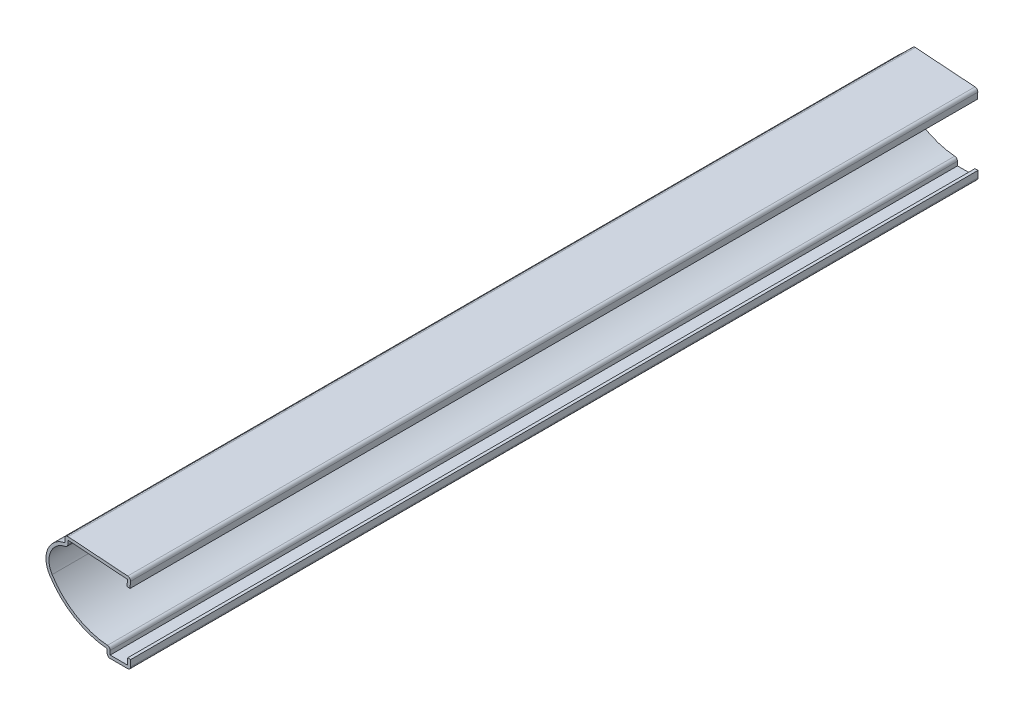
ISO-10303-21;
HEADER;
FILE_DESCRIPTION(('STEP AP214'),'2;1');
FILE_NAME('part.step','',(''),(''),'','','');
FILE_SCHEMA(('AUTOMOTIVE_DESIGN { 1 0 10303 214 1 1 1 1 }'));
ENDSEC;
DATA;
#1=APPLICATION_CONTEXT('core data for automotive mechanical design processes');
#2=APPLICATION_PROTOCOL_DEFINITION('international standard','automotive_design',2000,#1);
#3=PRODUCT_CONTEXT('',#1,'mechanical');
#4=PRODUCT('Part','Part','',(#3));
#5=PRODUCT_RELATED_PRODUCT_CATEGORY('part','',(#4));
#6=PRODUCT_DEFINITION_FORMATION('','',#4);
#7=PRODUCT_DEFINITION_CONTEXT('part definition',#1,'design');
#8=PRODUCT_DEFINITION('design','',#6,#7);
#9=PRODUCT_DEFINITION_SHAPE('','',#8);
#10=(LENGTH_UNIT() NAMED_UNIT(*) SI_UNIT(.MILLI.,.METRE.));
#11=(NAMED_UNIT(*) PLANE_ANGLE_UNIT() SI_UNIT($,.RADIAN.));
#12=(NAMED_UNIT(*) SI_UNIT($,.STERADIAN.) SOLID_ANGLE_UNIT());
#13=UNCERTAINTY_MEASURE_WITH_UNIT(LENGTH_MEASURE(1.E-05),#10,'distance_accuracy_value','');
#14=(GEOMETRIC_REPRESENTATION_CONTEXT(3) GLOBAL_UNCERTAINTY_ASSIGNED_CONTEXT((#13)) GLOBAL_UNIT_ASSIGNED_CONTEXT((#10,
#11,#12)) REPRESENTATION_CONTEXT('',''));
#15=CARTESIAN_POINT('',(0.,0.,0.));
#16=DIRECTION('',(0.,0.,1.));
#17=DIRECTION('',(1.,0.,0.));
#18=AXIS2_PLACEMENT_3D('',#15,#16,#17);
#19=CARTESIAN_POINT('',(-1.01341803902803,27.0598870027877,-285.75));
#20=DIRECTION('',(-0.997458699830735,0.0712470499879095,0.));
#21=DIRECTION('',(-0.0712470499879095,-0.997458699830735,0.));
#22=AXIS2_PLACEMENT_3D('',#19,#20,#21);
#23=PLANE('',#22);
#24=DIRECTION('',(-0.0712470499879096,-0.997458699830735,0.));
#25=VECTOR('',#24,1.);
#26=CARTESIAN_POINT('',(-1.01341803902803,27.0598870027877,0.));
#27=LINE('',#26,#25);
#28=CARTESIAN_POINT('',(-1.08580504181575,26.0464689637597,0.));
#29=VERTEX_POINT('',#28);
#30=CARTESIAN_POINT('',(-1.24020375331374,23.8848870027877,0.));
#31=VERTEX_POINT('',#30);
#32=EDGE_CURVE('E262',#29,#31,#27,.T.);
#33=ORIENTED_EDGE('',*,*,#32,.F.);
#34=DIRECTION('',(0.,0.,1.));
#35=VECTOR('',#34,1.);
#36=CARTESIAN_POINT('',(-1.08580504181575,26.0464689637597,-285.75));
#37=LINE('',#36,#35);
#38=CARTESIAN_POINT('',(-1.08580504181575,26.0464689637597,-285.75));
#39=VERTEX_POINT('',#38);
#40=EDGE_CURVE('E219',#39,#29,#37,.T.);
#41=ORIENTED_EDGE('',*,*,#40,.F.);
#42=DIRECTION('',(-0.0712470499879096,-0.997458699830735,0.));
#43=VECTOR('',#42,1.);
#44=CARTESIAN_POINT('',(-1.01341803902803,27.0598870027877,-285.75));
#45=LINE('',#44,#43);
#46=CARTESIAN_POINT('',(-1.24020375331374,23.8848870027877,-285.75));
#47=VERTEX_POINT('',#46);
#48=EDGE_CURVE('E201',#39,#47,#45,.T.);
#49=ORIENTED_EDGE('',*,*,#48,.T.);
#50=DIRECTION('',(0.,0.,1.));
#51=VECTOR('',#50,1.);
#52=CARTESIAN_POINT('',(-1.24020375331374,23.8848870027877,-285.75));
#53=LINE('',#52,#51);
#54=EDGE_CURVE('E209',#47,#31,#53,.T.);
#55=ORIENTED_EDGE('',*,*,#54,.T.);
#56=EDGE_LOOP('',(#33,#41,#49,#55));
#57=FACE_BOUND('',#56,.T.);
#58=ADVANCED_FACE('F35',(#57),#23,.T.);
#59=CARTESIAN_POINT('',(-22.2973870027877,27.561581960972,-285.75));
#60=DIRECTION('',(-0.0712470499879096,-0.997458699830735,0.));
#61=DIRECTION('',(0.997458699830735,-0.0712470499879096,0.));
#62=AXIS2_PLACEMENT_3D('',#59,#60,#61);
#63=PLANE('',#62);
#64=DIRECTION('',(0.997458699830735,-0.0712470499879096,0.));
#65=VECTOR('',#64,1.);
#66=CARTESIAN_POINT('',(-22.2973870027877,27.561581960972,0.));
#67=LINE('',#66,#65);
#68=CARTESIAN_POINT('',(-21.209,27.4838400322014,0.));
#69=VERTEX_POINT('',#68);
#70=EDGE_CURVE('E220',#69,#29,#67,.T.);
#71=ORIENTED_EDGE('',*,*,#70,.F.);
#72=DIRECTION('',(0.,0.,1.));
#73=VECTOR('',#72,1.);
#74=CARTESIAN_POINT('',(-21.209,27.4838400322014,-285.75));
#75=LINE('',#74,#73);
#76=CARTESIAN_POINT('',(-21.209,27.4838400322014,-285.75));
#77=VERTEX_POINT('',#76);
#78=EDGE_CURVE('E303',#77,#69,#75,.T.);
#79=ORIENTED_EDGE('',*,*,#78,.F.);
#80=DIRECTION('',(0.997458699830735,-0.0712470499879096,0.));
#81=VECTOR('',#80,1.);
#82=CARTESIAN_POINT('',(-22.2973870027877,27.561581960972,-285.75));
#83=LINE('',#82,#81);
#84=EDGE_CURVE('E217',#77,#39,#83,.T.);
#85=ORIENTED_EDGE('',*,*,#84,.T.);
#86=ORIENTED_EDGE('',*,*,#40,.T.);
#87=EDGE_LOOP('',(#71,#79,#85,#86));
#88=FACE_BOUND('',#87,.T.);
#89=ADVANCED_FACE('F394',(#88),#63,.T.);
#90=CARTESIAN_POINT('',(-21.209,26.19375,-285.75));
#91=DIRECTION('',(1.,0.,0.));
#92=DIRECTION('',(0.,0.,-1.));
#93=AXIS2_PLACEMENT_3D('',#90,#91,#92);
#94=PLANE('',#93);
#95=DIRECTION('',(0.,1.,0.));
#96=VECTOR('',#95,1.);
#97=CARTESIAN_POINT('',(-21.209,26.19375,0.));
#98=LINE('',#97,#96);
#99=CARTESIAN_POINT('',(-21.209,26.19375,0.));
#100=VERTEX_POINT('',#99);
#101=EDGE_CURVE('E223',#100,#69,#98,.T.);
#102=ORIENTED_EDGE('',*,*,#101,.F.);
#103=DIRECTION('',(0.,0.,1.));
#104=VECTOR('',#103,1.);
#105=CARTESIAN_POINT('',(-21.209,26.19375,-285.75));
#106=LINE('',#105,#104);
#107=CARTESIAN_POINT('',(-21.209,26.19375,-285.75));
#108=VERTEX_POINT('',#107);
#109=EDGE_CURVE('E368',#100,#108,#106,.F.);
#110=ORIENTED_EDGE('',*,*,#109,.T.);
#111=DIRECTION('',(0.,1.,0.));
#112=VECTOR('',#111,1.);
#113=CARTESIAN_POINT('',(-21.209,26.19375,-285.75));
#114=LINE('',#113,#112);
#115=EDGE_CURVE('E259',#108,#77,#114,.T.);
#116=ORIENTED_EDGE('',*,*,#115,.T.);
#117=ORIENTED_EDGE('',*,*,#78,.T.);
#118=EDGE_LOOP('',(#102,#110,#116,#117));
#119=FACE_BOUND('',#118,.T.);
#120=ADVANCED_FACE('F477',(#119),#94,.T.);
#121=CARTESIAN_POINT('',(-20.6375,18.4166200666634,-285.75));
#122=DIRECTION('',(0.,0.,1.));
#123=DIRECTION('',(1.,0.,0.));
#124=AXIS2_PLACEMENT_3D('',#121,#122,#123);
#125=CYLINDRICAL_SURFACE('',#124,6.9215);
#126=CARTESIAN_POINT('',(-20.6375,18.4166200666634,-285.75));
#127=DIRECTION('',(0.,0.,1.));
#128=DIRECTION('',(1.,0.,0.));
#129=AXIS2_PLACEMENT_3D('',#126,#127,#128);
#130=CIRCLE('',#129,6.9215);
#131=CARTESIAN_POINT('',(-26.5011918104031,14.7390827653418,-285.75));
#132=VERTEX_POINT('',#131);
#133=CARTESIAN_POINT('',(-22.0218,25.1982773685329,-285.75));
#134=VERTEX_POINT('',#133);
#135=EDGE_CURVE('E256',#132,#134,#130,.F.);
#136=ORIENTED_EDGE('',*,*,#135,.T.);
#137=DIRECTION('',(0.,0.,1.));
#138=VECTOR('',#137,1.);
#139=CARTESIAN_POINT('',(-22.0218,25.1982773685329,-285.75));
#140=LINE('',#139,#138);
#141=CARTESIAN_POINT('',(-22.0218,25.1982773685329,0.));
#142=VERTEX_POINT('',#141);
#143=EDGE_CURVE('E365',#134,#142,#140,.T.);
#144=ORIENTED_EDGE('',*,*,#143,.T.);
#145=CARTESIAN_POINT('',(-20.6375,18.4166200666634,0.));
#146=DIRECTION('',(0.,0.,1.));
#147=DIRECTION('',(1.,0.,0.));
#148=AXIS2_PLACEMENT_3D('',#145,#146,#147);
#149=CIRCLE('',#148,6.9215);
#150=CARTESIAN_POINT('',(-26.5011918104031,14.7390827653418,0.));
#151=VERTEX_POINT('',#150);
#152=EDGE_CURVE('E297',#151,#142,#149,.F.);
#153=ORIENTED_EDGE('',*,*,#152,.F.);
#154=DIRECTION('',(0.,0.,1.));
#155=VECTOR('',#154,1.);
#156=CARTESIAN_POINT('',(-26.5011918104031,14.7390827653418,-285.75));
#157=LINE('',#156,#155);
#158=EDGE_CURVE('E306',#132,#151,#157,.T.);
#159=ORIENTED_EDGE('',*,*,#158,.F.);
#160=EDGE_LOOP('',(#136,#144,#153,#159));
#161=FACE_BOUND('',#160,.T.);
#162=ADVANCED_FACE('F405',(#161),#125,.F.);
#163=CARTESIAN_POINT('',(-5.84378212971693,27.6948105057775,-285.75));
#164=DIRECTION('',(0.,0.,1.));
#165=DIRECTION('',(1.,0.,0.));
#166=AXIS2_PLACEMENT_3D('',#163,#164,#165);
#167=CYLINDRICAL_SURFACE('',#166,24.384);
#168=CARTESIAN_POINT('',(-5.84378212971693,27.6948105057775,0.));
#169=DIRECTION('',(0.,0.,1.));
#170=DIRECTION('',(1.,0.,0.));
#171=AXIS2_PLACEMENT_3D('',#168,#169,#170);
#172=CIRCLE('',#171,24.384);
#173=CARTESIAN_POINT('',(-7.85375128518868,3.3937924202311,0.));
#174=VERTEX_POINT('',#173);
#175=EDGE_CURVE('E295',#174,#151,#172,.F.);
#176=ORIENTED_EDGE('',*,*,#175,.F.);
#177=DIRECTION('',(0.,0.,1.));
#178=VECTOR('',#177,1.);
#179=CARTESIAN_POINT('',(-7.85375128518868,3.3937924202311,-285.75));
#180=LINE('',#179,#178);
#181=CARTESIAN_POINT('',(-7.85375128518868,3.3937924202311,-285.75));
#182=VERTEX_POINT('',#181);
#183=EDGE_CURVE('E363',#174,#182,#180,.F.);
#184=ORIENTED_EDGE('',*,*,#183,.T.);
#185=CARTESIAN_POINT('',(-5.84378212971693,27.6948105057775,-285.75));
#186=DIRECTION('',(0.,0.,1.));
#187=DIRECTION('',(1.,0.,0.));
#188=AXIS2_PLACEMENT_3D('',#185,#186,#187);
#189=CIRCLE('',#188,24.384);
#190=EDGE_CURVE('E254',#182,#132,#189,.F.);
#191=ORIENTED_EDGE('',*,*,#190,.T.);
#192=ORIENTED_EDGE('',*,*,#158,.T.);
#193=EDGE_LOOP('',(#176,#184,#191,#192));
#194=FACE_BOUND('',#193,.T.);
#195=ADVANCED_FACE('F410',(#194),#167,.F.);
#196=CARTESIAN_POINT('',(-6.9215,0.,-285.75));
#197=DIRECTION('',(1.,0.,0.));
#198=DIRECTION('',(0.,0.,-1.));
#199=AXIS2_PLACEMENT_3D('',#196,#197,#198);
#200=PLANE('',#199);
#201=DIRECTION('',(0.,1.,0.));
#202=VECTOR('',#201,1.);
#203=CARTESIAN_POINT('',(-6.9215,0.,-285.75));
#204=LINE('',#203,#202);
#205=CARTESIAN_POINT('',(-6.9215,1.016,-285.75));
#206=VERTEX_POINT('',#205);
#207=CARTESIAN_POINT('',(-6.9215,2.38125,-285.75));
#208=VERTEX_POINT('',#207);
#209=EDGE_CURVE('E251',#206,#208,#204,.T.);
#210=ORIENTED_EDGE('',*,*,#209,.T.);
#211=DIRECTION('',(0.,0.,1.));
#212=VECTOR('',#211,1.);
#213=CARTESIAN_POINT('',(-6.9215,2.38125,-285.75));
#214=LINE('',#213,#212);
#215=CARTESIAN_POINT('',(-6.9215,2.38125,0.));
#216=VERTEX_POINT('',#215);
#217=EDGE_CURVE('E360',#208,#216,#214,.T.);
#218=ORIENTED_EDGE('',*,*,#217,.T.);
#219=DIRECTION('',(0.,1.,0.));
#220=VECTOR('',#219,1.);
#221=CARTESIAN_POINT('',(-6.9215,0.,0.));
#222=LINE('',#221,#220);
#223=CARTESIAN_POINT('',(-6.9215,1.016,0.));
#224=VERTEX_POINT('',#223);
#225=EDGE_CURVE('E292',#224,#216,#222,.T.);
#226=ORIENTED_EDGE('',*,*,#225,.F.);
#227=DIRECTION('',(0.,0.,1.));
#228=VECTOR('',#227,1.);
#229=CARTESIAN_POINT('',(-6.9215,1.016,-285.75));
#230=LINE('',#229,#228);
#231=EDGE_CURVE('E309',#206,#224,#230,.T.);
#232=ORIENTED_EDGE('',*,*,#231,.F.);
#233=EDGE_LOOP('',(#210,#218,#226,#232));
#234=FACE_BOUND('',#233,.T.);
#235=ADVANCED_FACE('F419',(#234),#200,.T.);
#236=CARTESIAN_POINT('',(0.,1.016,-285.75));
#237=DIRECTION('',(0.,1.,0.));
#238=DIRECTION('',(-1.,0.,0.));
#239=AXIS2_PLACEMENT_3D('',#236,#237,#238);
#240=PLANE('',#239);
#241=DIRECTION('',(-1.,0.,0.));
#242=VECTOR('',#241,1.);
#243=CARTESIAN_POINT('',(0.,1.016,0.));
#244=LINE('',#243,#242);
#245=CARTESIAN_POINT('',(-1.016,1.016,0.));
#246=VERTEX_POINT('',#245);
#247=EDGE_CURVE('E289',#246,#224,#244,.T.);
#248=ORIENTED_EDGE('',*,*,#247,.F.);
#249=DIRECTION('',(0.,0.,1.));
#250=VECTOR('',#249,1.);
#251=CARTESIAN_POINT('',(-1.016,1.016,-285.75));
#252=LINE('',#251,#250);
#253=CARTESIAN_POINT('',(-1.016,1.016,-285.75));
#254=VERTEX_POINT('',#253);
#255=EDGE_CURVE('E311',#254,#246,#252,.T.);
#256=ORIENTED_EDGE('',*,*,#255,.F.);
#257=DIRECTION('',(-1.,0.,0.));
#258=VECTOR('',#257,1.);
#259=CARTESIAN_POINT('',(0.,1.016,-285.75));
#260=LINE('',#259,#258);
#261=EDGE_CURVE('E248',#254,#206,#260,.T.);
#262=ORIENTED_EDGE('',*,*,#261,.T.);
#263=ORIENTED_EDGE('',*,*,#231,.T.);
#264=EDGE_LOOP('',(#248,#256,#262,#263));
#265=FACE_BOUND('',#264,.T.);
#266=ADVANCED_FACE('F424',(#265),#240,.T.);
#267=CARTESIAN_POINT('',(-1.016,3.175,-285.75));
#268=DIRECTION('',(-1.,0.,0.));
#269=DIRECTION('',(0.,-1.,0.));
#270=AXIS2_PLACEMENT_3D('',#267,#268,#269);
#271=PLANE('',#270);
#272=DIRECTION('',(0.,-1.,0.));
#273=VECTOR('',#272,1.);
#274=CARTESIAN_POINT('',(-1.016,3.175,0.));
#275=LINE('',#274,#273);
#276=CARTESIAN_POINT('',(-1.016,3.175,0.));
#277=VERTEX_POINT('',#276);
#278=EDGE_CURVE('E286',#277,#246,#275,.T.);
#279=ORIENTED_EDGE('',*,*,#278,.F.);
#280=DIRECTION('',(0.,0.,1.));
#281=VECTOR('',#280,1.);
#282=CARTESIAN_POINT('',(-1.016,3.175,-285.75));
#283=LINE('',#282,#281);
#284=CARTESIAN_POINT('',(-1.016,3.175,-285.75));
#285=VERTEX_POINT('',#284);
#286=EDGE_CURVE('E313',#285,#277,#283,.T.);
#287=ORIENTED_EDGE('',*,*,#286,.F.);
#288=DIRECTION('',(0.,-1.,0.));
#289=VECTOR('',#288,1.);
#290=CARTESIAN_POINT('',(-1.016,3.175,-285.75));
#291=LINE('',#290,#289);
#292=EDGE_CURVE('E245',#285,#254,#291,.T.);
#293=ORIENTED_EDGE('',*,*,#292,.T.);
#294=ORIENTED_EDGE('',*,*,#255,.T.);
#295=EDGE_LOOP('',(#279,#287,#293,#294));
#296=FACE_BOUND('',#295,.T.);
#297=ADVANCED_FACE('F428',(#296),#271,.T.);
#298=CARTESIAN_POINT('',(-1.016,3.175,-285.75));
#299=DIRECTION('',(0.,-1.,0.));
#300=DIRECTION('',(0.,0.,-1.));
#301=AXIS2_PLACEMENT_3D('',#298,#299,#300);
#302=PLANE('',#301);
#303=DIRECTION('',(1.,0.,0.));
#304=VECTOR('',#303,1.);
#305=CARTESIAN_POINT('',(-1.016,3.175,0.));
#306=LINE('',#305,#304);
#307=CARTESIAN_POINT('',(0.,3.175,0.));
#308=VERTEX_POINT('',#307);
#309=EDGE_CURVE('E284',#277,#308,#306,.T.);
#310=ORIENTED_EDGE('',*,*,#309,.T.);
#311=DIRECTION('',(0.,0.,1.));
#312=VECTOR('',#311,1.);
#313=CARTESIAN_POINT('',(0.,3.175,-285.75));
#314=LINE('',#313,#312);
#315=CARTESIAN_POINT('',(0.,3.175,-285.75));
#316=VERTEX_POINT('',#315);
#317=EDGE_CURVE('E315',#316,#308,#314,.T.);
#318=ORIENTED_EDGE('',*,*,#317,.F.);
#319=DIRECTION('',(1.,0.,0.));
#320=VECTOR('',#319,1.);
#321=CARTESIAN_POINT('',(-1.016,3.175,-285.75));
#322=LINE('',#321,#320);
#323=EDGE_CURVE('E243',#285,#316,#322,.T.);
#324=ORIENTED_EDGE('',*,*,#323,.F.);
#325=ORIENTED_EDGE('',*,*,#286,.T.);
#326=EDGE_LOOP('',(#310,#318,#324,#325));
#327=FACE_BOUND('',#326,.T.);
#328=ADVANCED_FACE('F432',(#327),#302,.F.);
#329=CARTESIAN_POINT('',(0.,3.175,-285.75));
#330=DIRECTION('',(-1.,0.,0.));
#331=DIRECTION('',(0.,-1.,0.));
#332=AXIS2_PLACEMENT_3D('',#329,#330,#331);
#333=PLANE('',#332);
#334=DIRECTION('',(0.,-1.,0.));
#335=VECTOR('',#334,1.);
#336=CARTESIAN_POINT('',(0.,3.175,0.));
#337=LINE('',#336,#335);
#338=CARTESIAN_POINT('',(0.,1.016,0.));
#339=VERTEX_POINT('',#338);
#340=EDGE_CURVE('E281',#308,#339,#337,.T.);
#341=ORIENTED_EDGE('',*,*,#340,.T.);
#342=DIRECTION('',(0.,0.,1.));
#343=VECTOR('',#342,1.);
#344=CARTESIAN_POINT('',(0.,1.016,-285.75));
#345=LINE('',#344,#343);
#346=CARTESIAN_POINT('',(0.,1.016,-285.75));
#347=VERTEX_POINT('',#346);
#348=EDGE_CURVE('E344',#339,#347,#345,.F.);
#349=ORIENTED_EDGE('',*,*,#348,.T.);
#350=DIRECTION('',(0.,-1.,0.));
#351=VECTOR('',#350,1.);
#352=CARTESIAN_POINT('',(0.,3.175,-285.75));
#353=LINE('',#352,#351);
#354=EDGE_CURVE('E241',#316,#347,#353,.T.);
#355=ORIENTED_EDGE('',*,*,#354,.F.);
#356=ORIENTED_EDGE('',*,*,#317,.T.);
#357=EDGE_LOOP('',(#341,#349,#355,#356));
#358=FACE_BOUND('',#357,.T.);
#359=ADVANCED_FACE('F591',(#358),#333,.F.);
#360=CARTESIAN_POINT('',(0.,0.,-285.75));
#361=DIRECTION('',(0.,1.,0.));
#362=DIRECTION('',(-1.,0.,0.));
#363=AXIS2_PLACEMENT_3D('',#360,#361,#362);
#364=PLANE('',#363);
#365=DIRECTION('',(-1.,0.,0.));
#366=VECTOR('',#365,1.);
#367=CARTESIAN_POINT('',(0.,0.,-285.75));
#368=LINE('',#367,#366);
#369=CARTESIAN_POINT('',(-1.016,0.,-285.75));
#370=VERTEX_POINT('',#369);
#371=CARTESIAN_POINT('',(-6.9215,0.,-285.75));
#372=VERTEX_POINT('',#371);
#373=EDGE_CURVE('E238',#370,#372,#368,.T.);
#374=ORIENTED_EDGE('',*,*,#373,.F.);
#375=DIRECTION('',(0.,0.,1.));
#376=VECTOR('',#375,1.);
#377=CARTESIAN_POINT('',(-1.016,0.,-285.75));
#378=LINE('',#377,#376);
#379=CARTESIAN_POINT('',(-1.016,0.,0.));
#380=VERTEX_POINT('',#379);
#381=EDGE_CURVE('E329',#370,#380,#378,.T.);
#382=ORIENTED_EDGE('',*,*,#381,.T.);
#383=DIRECTION('',(-1.,0.,0.));
#384=VECTOR('',#383,1.);
#385=CARTESIAN_POINT('',(0.,0.,0.));
#386=LINE('',#385,#384);
#387=CARTESIAN_POINT('',(-6.9215,0.,0.));
#388=VERTEX_POINT('',#387);
#389=EDGE_CURVE('E278',#380,#388,#386,.T.);
#390=ORIENTED_EDGE('',*,*,#389,.T.);
#391=DIRECTION('',(0.,0.,1.));
#392=VECTOR('',#391,1.);
#393=CARTESIAN_POINT('',(-6.9215,0.,-285.75));
#394=LINE('',#393,#392);
#395=EDGE_CURVE('E302',#388,#372,#394,.F.);
#396=ORIENTED_EDGE('',*,*,#395,.T.);
#397=EDGE_LOOP('',(#374,#382,#390,#396));
#398=FACE_BOUND('',#397,.T.);
#399=ADVANCED_FACE('F442',(#398),#364,.F.);
#400=CARTESIAN_POINT('',(-7.9375,0.,-285.75));
#401=DIRECTION('',(1.,0.,0.));
#402=DIRECTION('',(0.,0.,-1.));
#403=AXIS2_PLACEMENT_3D('',#400,#401,#402);
#404=PLANE('',#403);
#405=DIRECTION('',(0.,1.,0.));
#406=VECTOR('',#405,1.);
#407=CARTESIAN_POINT('',(-7.9375,0.,-285.75));
#408=LINE('',#407,#406);
#409=CARTESIAN_POINT('',(-7.9375,1.016,-285.75));
#410=VERTEX_POINT('',#409);
#411=CARTESIAN_POINT('',(-7.9375,2.38125,-285.75));
#412=VERTEX_POINT('',#411);
#413=EDGE_CURVE('E236',#410,#412,#408,.T.);
#414=ORIENTED_EDGE('',*,*,#413,.F.);
#415=DIRECTION('',(0.,0.,1.));
#416=VECTOR('',#415,1.);
#417=CARTESIAN_POINT('',(-7.9375,1.016,-285.75));
#418=LINE('',#417,#416);
#419=CARTESIAN_POINT('',(-7.9375,1.016,0.));
#420=VERTEX_POINT('',#419);
#421=EDGE_CURVE('E357',#410,#420,#418,.T.);
#422=ORIENTED_EDGE('',*,*,#421,.T.);
#423=DIRECTION('',(0.,1.,0.));
#424=VECTOR('',#423,1.);
#425=CARTESIAN_POINT('',(-7.9375,0.,0.));
#426=LINE('',#425,#424);
#427=CARTESIAN_POINT('',(-7.9375,2.38125,0.));
#428=VERTEX_POINT('',#427);
#429=EDGE_CURVE('E276',#420,#428,#426,.T.);
#430=ORIENTED_EDGE('',*,*,#429,.T.);
#431=DIRECTION('',(0.,0.,1.));
#432=VECTOR('',#431,1.);
#433=CARTESIAN_POINT('',(-7.9375,2.38125,-285.75));
#434=LINE('',#433,#432);
#435=EDGE_CURVE('E318',#412,#428,#434,.T.);
#436=ORIENTED_EDGE('',*,*,#435,.F.);
#437=EDGE_LOOP('',(#414,#422,#430,#436));
#438=FACE_BOUND('',#437,.T.);
#439=ADVANCED_FACE('F453',(#438),#404,.F.);
#440=CARTESIAN_POINT('',(-5.84378212971693,27.6948105057775,-285.75));
#441=DIRECTION('',(0.,0.,1.));
#442=DIRECTION('',(1.,0.,0.));
#443=AXIS2_PLACEMENT_3D('',#440,#441,#442);
#444=CYLINDRICAL_SURFACE('',#443,25.4);
#445=CARTESIAN_POINT('',(-5.84378212971693,27.6948105057775,0.));
#446=DIRECTION('',(0.,0.,-1.));
#447=DIRECTION('',(-1.,0.,0.));
#448=AXIS2_PLACEMENT_3D('',#445,#446,#447);
#449=CIRCLE('',#448,25.4);
#450=CARTESIAN_POINT('',(-27.361917213765,14.199260776157,0.));
#451=VERTEX_POINT('',#450);
#452=EDGE_CURVE('E274',#428,#451,#449,.T.);
#453=ORIENTED_EDGE('',*,*,#452,.T.);
#454=DIRECTION('',(0.,0.,1.));
#455=VECTOR('',#454,1.);
#456=CARTESIAN_POINT('',(-27.361917213765,14.199260776157,-285.75));
#457=LINE('',#456,#455);
#458=CARTESIAN_POINT('',(-27.361917213765,14.199260776157,-285.75));
#459=VERTEX_POINT('',#458);
#460=EDGE_CURVE('E321',#459,#451,#457,.T.);
#461=ORIENTED_EDGE('',*,*,#460,.F.);
#462=CARTESIAN_POINT('',(-5.84378212971693,27.6948105057775,-285.75));
#463=DIRECTION('',(0.,0.,-1.));
#464=DIRECTION('',(-1.,0.,0.));
#465=AXIS2_PLACEMENT_3D('',#462,#463,#464);
#466=CIRCLE('',#465,25.4);
#467=EDGE_CURVE('E234',#412,#459,#466,.T.);
#468=ORIENTED_EDGE('',*,*,#467,.F.);
#469=ORIENTED_EDGE('',*,*,#435,.T.);
#470=EDGE_LOOP('',(#453,#461,#468,#469));
#471=FACE_BOUND('',#470,.T.);
#472=ADVANCED_FACE('F460',(#471),#444,.T.);
#473=CARTESIAN_POINT('',(-20.6375,18.4166200666634,-285.75));
#474=DIRECTION('',(0.,0.,1.));
#475=DIRECTION('',(1.,0.,0.));
#476=AXIS2_PLACEMENT_3D('',#473,#474,#475);
#477=CYLINDRICAL_SURFACE('',#476,7.9375);
#478=CARTESIAN_POINT('',(-20.6375,18.4166200666634,0.));
#479=DIRECTION('',(0.,0.,-1.));
#480=DIRECTION('',(-1.,0.,0.));
#481=AXIS2_PLACEMENT_3D('',#478,#479,#480);
#482=CIRCLE('',#481,7.9375);
#483=CARTESIAN_POINT('',(-22.225,26.19375,0.));
#484=VERTEX_POINT('',#483);
#485=EDGE_CURVE('E272',#451,#484,#482,.T.);
#486=ORIENTED_EDGE('',*,*,#485,.T.);
#487=DIRECTION('',(0.,0.,1.));
#488=VECTOR('',#487,1.);
#489=CARTESIAN_POINT('',(-22.225,26.19375,-285.75));
#490=LINE('',#489,#488);
#491=CARTESIAN_POINT('',(-22.225,26.19375,-285.75));
#492=VERTEX_POINT('',#491);
#493=EDGE_CURVE('E324',#492,#484,#490,.T.);
#494=ORIENTED_EDGE('',*,*,#493,.F.);
#495=CARTESIAN_POINT('',(-20.6375,18.4166200666634,-285.75));
#496=DIRECTION('',(0.,0.,-1.));
#497=DIRECTION('',(-1.,0.,0.));
#498=AXIS2_PLACEMENT_3D('',#495,#496,#497);
#499=CIRCLE('',#498,7.9375);
#500=EDGE_CURVE('E232',#459,#492,#499,.T.);
#501=ORIENTED_EDGE('',*,*,#500,.F.);
#502=ORIENTED_EDGE('',*,*,#460,.T.);
#503=EDGE_LOOP('',(#486,#494,#501,#502));
#504=FACE_BOUND('',#503,.T.);
#505=ADVANCED_FACE('F463',(#504),#477,.T.);
#506=CARTESIAN_POINT('',(-22.225,26.19375,-285.75));
#507=DIRECTION('',(1.,0.,0.));
#508=DIRECTION('',(0.,0.,-1.));
#509=AXIS2_PLACEMENT_3D('',#506,#507,#508);
#510=PLANE('',#509);
#511=DIRECTION('',(0.,1.,0.));
#512=VECTOR('',#511,1.);
#513=CARTESIAN_POINT('',(-22.225,26.19375,0.));
#514=LINE('',#513,#512);
#515=CARTESIAN_POINT('',(-22.225,27.4838400322014,0.));
#516=VERTEX_POINT('',#515);
#517=EDGE_CURVE('E269',#484,#516,#514,.T.);
#518=ORIENTED_EDGE('',*,*,#517,.T.);
#519=DIRECTION('',(0.,0.,1.));
#520=VECTOR('',#519,1.);
#521=CARTESIAN_POINT('',(-22.225,27.4838400322014,-285.75));
#522=LINE('',#521,#520);
#523=CARTESIAN_POINT('',(-22.225,27.4838400322014,-285.75));
#524=VERTEX_POINT('',#523);
#525=EDGE_CURVE('E11',#516,#524,#522,.F.);
#526=ORIENTED_EDGE('',*,*,#525,.T.);
#527=DIRECTION('',(0.,1.,0.));
#528=VECTOR('',#527,1.);
#529=CARTESIAN_POINT('',(-22.225,26.19375,-285.75));
#530=LINE('',#529,#528);
#531=EDGE_CURVE('E229',#492,#524,#530,.T.);
#532=ORIENTED_EDGE('',*,*,#531,.F.);
#533=ORIENTED_EDGE('',*,*,#493,.T.);
#534=EDGE_LOOP('',(#518,#526,#532,#533));
#535=FACE_BOUND('',#534,.T.);
#536=ADVANCED_FACE('F466',(#535),#510,.F.);
#537=CARTESIAN_POINT('',(-22.225,28.575,-285.75));
#538=DIRECTION('',(-0.0712470499879096,-0.997458699830735,0.));
#539=DIRECTION('',(0.997458699830735,-0.0712470499879096,0.));
#540=AXIS2_PLACEMENT_3D('',#537,#538,#539);
#541=PLANE('',#540);
#542=DIRECTION('',(0.997458699830735,-0.0712470499879096,0.));
#543=VECTOR('',#542,1.);
#544=CARTESIAN_POINT('',(-22.225,28.575,0.));
#545=LINE('',#544,#543);
#546=CARTESIAN_POINT('',(-21.1366129972123,28.4972580712294,0.));
#547=VERTEX_POINT('',#546);
#548=CARTESIAN_POINT('',(-1.01341803902803,27.0598870027877,0.));
#549=VERTEX_POINT('',#548);
#550=EDGE_CURVE('E267',#547,#549,#545,.T.);
#551=ORIENTED_EDGE('',*,*,#550,.T.);
#552=DIRECTION('',(0.,0.,1.));
#553=VECTOR('',#552,1.);
#554=CARTESIAN_POINT('',(-1.01341803902803,27.0598870027877,-285.75));
#555=LINE('',#554,#553);
#556=CARTESIAN_POINT('',(-1.01341803902803,27.0598870027877,-285.75));
#557=VERTEX_POINT('',#556);
#558=EDGE_CURVE('E43',#549,#557,#555,.F.);
#559=ORIENTED_EDGE('',*,*,#558,.T.);
#560=DIRECTION('',(0.997458699830735,-0.0712470499879096,0.));
#561=VECTOR('',#560,1.);
#562=CARTESIAN_POINT('',(-22.225,28.575,-285.75));
#563=LINE('',#562,#561);
#564=CARTESIAN_POINT('',(-21.1366129972123,28.4972580712294,-285.75));
#565=VERTEX_POINT('',#564);
#566=EDGE_CURVE('E227',#565,#557,#563,.T.);
#567=ORIENTED_EDGE('',*,*,#566,.F.);
#568=DIRECTION('',(0.,0.,1.));
#569=VECTOR('',#568,1.);
#570=CARTESIAN_POINT('',(-21.1366129972123,28.4972580712294,-285.75));
#571=LINE('',#570,#569);
#572=EDGE_CURVE('E373',#565,#547,#571,.T.);
#573=ORIENTED_EDGE('',*,*,#572,.T.);
#574=EDGE_LOOP('',(#551,#559,#567,#573));
#575=FACE_BOUND('',#574,.T.);
#576=ADVANCED_FACE('F377',(#575),#541,.F.);
#577=CARTESIAN_POINT('',(0.,26.9875,-285.75));
#578=DIRECTION('',(-0.997458699830735,0.0712470499879095,0.));
#579=DIRECTION('',(-0.0712470499879095,-0.997458699830735,0.));
#580=AXIS2_PLACEMENT_3D('',#577,#578,#579);
#581=PLANE('',#580);
#582=DIRECTION('',(-0.0712470499879096,-0.997458699830735,0.));
#583=VECTOR('',#582,1.);
#584=CARTESIAN_POINT('',(0.,26.9875,-285.75));
#585=LINE('',#584,#583);
#586=CARTESIAN_POINT('',(-0.072387002787719,25.974081960972,-285.75));
#587=VERTEX_POINT('',#586);
#588=CARTESIAN_POINT('',(-0.226785714285717,23.8125,-285.75));
#589=VERTEX_POINT('',#588);
#590=EDGE_CURVE('E203',#587,#589,#585,.T.);
#591=ORIENTED_EDGE('',*,*,#590,.F.);
#592=DIRECTION('',(0.,0.,1.));
#593=VECTOR('',#592,1.);
#594=CARTESIAN_POINT('',(-0.072387002787719,25.974081960972,-285.75));
#595=LINE('',#594,#593);
#596=CARTESIAN_POINT('',(-0.072387002787719,25.974081960972,0.));
#597=VERTEX_POINT('',#596);
#598=EDGE_CURVE('E370',#587,#597,#595,.T.);
#599=ORIENTED_EDGE('',*,*,#598,.T.);
#600=DIRECTION('',(-0.0712470499879096,-0.997458699830735,0.));
#601=VECTOR('',#600,1.);
#602=CARTESIAN_POINT('',(0.,26.9875,0.));
#603=LINE('',#602,#601);
#604=CARTESIAN_POINT('',(-0.226785714285717,23.8125,0.));
#605=VERTEX_POINT('',#604);
#606=EDGE_CURVE('E265',#597,#605,#603,.T.);
#607=ORIENTED_EDGE('',*,*,#606,.T.);
#608=DIRECTION('',(0.,0.,1.));
#609=VECTOR('',#608,1.);
#610=CARTESIAN_POINT('',(-0.226785714285717,23.8125,-285.75));
#611=LINE('',#610,#609);
#612=EDGE_CURVE('E216',#589,#605,#611,.T.);
#613=ORIENTED_EDGE('',*,*,#612,.F.);
#614=EDGE_LOOP('',(#591,#599,#607,#613));
#615=FACE_BOUND('',#614,.T.);
#616=ADVANCED_FACE('F389',(#615),#581,.F.);
#617=CARTESIAN_POINT('',(-0.226785714285717,23.8125,-285.75));
#618=DIRECTION('',(0.0712470499879081,0.997458699830735,0.));
#619=DIRECTION('',(-0.997458699830735,0.0712470499879081,0.));
#620=AXIS2_PLACEMENT_3D('',#617,#618,#619);
#621=PLANE('',#620);
#622=DIRECTION('',(-0.997458699830735,0.0712470499879081,0.));
#623=VECTOR('',#622,1.);
#624=CARTESIAN_POINT('',(-0.226785714285717,23.8125,0.));
#625=LINE('',#624,#623);
#626=EDGE_CURVE('E212',#605,#31,#625,.T.);
#627=ORIENTED_EDGE('',*,*,#626,.T.);
#628=ORIENTED_EDGE('',*,*,#54,.F.);
#629=DIRECTION('',(-0.997458699830735,0.0712470499879081,0.));
#630=VECTOR('',#629,1.);
#631=CARTESIAN_POINT('',(-0.226785714285717,23.8125,-285.75));
#632=LINE('',#631,#630);
#633=EDGE_CURVE('E195',#589,#47,#632,.T.);
#634=ORIENTED_EDGE('',*,*,#633,.F.);
#635=ORIENTED_EDGE('',*,*,#612,.T.);
#636=EDGE_LOOP('',(#627,#628,#634,#635));
#637=FACE_BOUND('',#636,.T.);
#638=ADVANCED_FACE('F210',(#637),#621,.F.);
#639=CARTESIAN_POINT('',(-20.6375,18.4166200666634,-285.75));
#640=DIRECTION('',(0.,0.,-1.));
#641=DIRECTION('',(-1.,0.,0.));
#642=AXIS2_PLACEMENT_3D('',#639,#640,#641);
#643=PLANE('',#642);
#644=ORIENTED_EDGE('',*,*,#354,.T.);
#645=CARTESIAN_POINT('',(-1.016,1.016,-285.75));
#646=DIRECTION('',(0.,0.,-1.));
#647=DIRECTION('',(-1.,0.,0.));
#648=AXIS2_PLACEMENT_3D('',#645,#646,#647);
#649=CIRCLE('',#648,1.016);
#650=EDGE_CURVE('E355',#347,#370,#649,.T.);
#651=ORIENTED_EDGE('',*,*,#650,.T.);
#652=ORIENTED_EDGE('',*,*,#373,.T.);
#653=CARTESIAN_POINT('',(-6.9215,1.016,-285.75));
#654=DIRECTION('',(0.,0.,-1.));
#655=DIRECTION('',(-1.,0.,0.));
#656=AXIS2_PLACEMENT_3D('',#653,#654,#655);
#657=CIRCLE('',#656,1.016);
#658=EDGE_CURVE('E353',#372,#410,#657,.T.);
#659=ORIENTED_EDGE('',*,*,#658,.T.);
#660=ORIENTED_EDGE('',*,*,#413,.T.);
#661=ORIENTED_EDGE('',*,*,#467,.T.);
#662=ORIENTED_EDGE('',*,*,#500,.T.);
#663=ORIENTED_EDGE('',*,*,#531,.T.);
#664=CARTESIAN_POINT('',(-21.209,27.4838400322014,-285.75));
#665=DIRECTION('',(0.,0.,-1.));
#666=DIRECTION('',(-1.,0.,0.));
#667=AXIS2_PLACEMENT_3D('',#664,#665,#666);
#668=CIRCLE('',#667,1.016);
#669=EDGE_CURVE('E346',#524,#565,#668,.T.);
#670=ORIENTED_EDGE('',*,*,#669,.T.);
#671=ORIENTED_EDGE('',*,*,#566,.T.);
#672=CARTESIAN_POINT('',(-1.08580504181575,26.0464689637597,-285.75));
#673=DIRECTION('',(0.,0.,-1.));
#674=DIRECTION('',(-1.,0.,0.));
#675=AXIS2_PLACEMENT_3D('',#672,#673,#674);
#676=CIRCLE('',#675,1.016);
#677=EDGE_CURVE('E50',#557,#587,#676,.T.);
#678=ORIENTED_EDGE('',*,*,#677,.T.);
#679=ORIENTED_EDGE('',*,*,#590,.T.);
#680=ORIENTED_EDGE('',*,*,#633,.T.);
#681=ORIENTED_EDGE('',*,*,#48,.F.);
#682=ORIENTED_EDGE('',*,*,#84,.F.);
#683=ORIENTED_EDGE('',*,*,#115,.F.);
#684=CARTESIAN_POINT('',(-22.225,26.19375,-285.75));
#685=DIRECTION('',(0.,0.,-1.));
#686=DIRECTION('',(-1.,0.,0.));
#687=AXIS2_PLACEMENT_3D('',#684,#685,#686);
#688=CIRCLE('',#687,1.016);
#689=EDGE_CURVE('E349',#108,#134,#688,.T.);
#690=ORIENTED_EDGE('',*,*,#689,.T.);
#691=ORIENTED_EDGE('',*,*,#135,.F.);
#692=ORIENTED_EDGE('',*,*,#190,.F.);
#693=CARTESIAN_POINT('',(-7.9375,2.38125,-285.75));
#694=DIRECTION('',(0.,0.,-1.));
#695=DIRECTION('',(-1.,0.,0.));
#696=AXIS2_PLACEMENT_3D('',#693,#694,#695);
#697=CIRCLE('',#696,1.016);
#698=EDGE_CURVE('E351',#182,#208,#697,.T.);
#699=ORIENTED_EDGE('',*,*,#698,.T.);
#700=ORIENTED_EDGE('',*,*,#209,.F.);
#701=ORIENTED_EDGE('',*,*,#261,.F.);
#702=ORIENTED_EDGE('',*,*,#292,.F.);
#703=ORIENTED_EDGE('',*,*,#323,.T.);
#704=EDGE_LOOP('',(#644,#651,#652,#659,#660,#661,#662,#663,#670,#671,#678,#679,#680,#681,#682,
#683,#690,#691,#692,#699,#700,#701,#702,#703));
#705=FACE_BOUND('',#704,.T.);
#706=ADVANCED_FACE('F198',(#705),#643,.T.);
#707=CARTESIAN_POINT('',(-20.6375,18.4166200666634,0.));
#708=DIRECTION('',(0.,0.,-1.));
#709=DIRECTION('',(-1.,0.,0.));
#710=AXIS2_PLACEMENT_3D('',#707,#708,#709);
#711=PLANE('',#710);
#712=ORIENTED_EDGE('',*,*,#389,.F.);
#713=CARTESIAN_POINT('',(-1.016,1.016,0.));
#714=DIRECTION('',(0.,0.,-1.));
#715=DIRECTION('',(-1.,0.,0.));
#716=AXIS2_PLACEMENT_3D('',#713,#714,#715);
#717=CIRCLE('',#716,1.016);
#718=EDGE_CURVE('E342',#380,#339,#717,.F.);
#719=ORIENTED_EDGE('',*,*,#718,.T.);
#720=ORIENTED_EDGE('',*,*,#340,.F.);
#721=ORIENTED_EDGE('',*,*,#309,.F.);
#722=ORIENTED_EDGE('',*,*,#278,.T.);
#723=ORIENTED_EDGE('',*,*,#247,.T.);
#724=ORIENTED_EDGE('',*,*,#225,.T.);
#725=CARTESIAN_POINT('',(-7.9375,2.38125,0.));
#726=DIRECTION('',(0.,0.,-1.));
#727=DIRECTION('',(-1.,0.,0.));
#728=AXIS2_PLACEMENT_3D('',#725,#726,#727);
#729=CIRCLE('',#728,1.016);
#730=EDGE_CURVE('E338',#216,#174,#729,.F.);
#731=ORIENTED_EDGE('',*,*,#730,.T.);
#732=ORIENTED_EDGE('',*,*,#175,.T.);
#733=ORIENTED_EDGE('',*,*,#152,.T.);
#734=CARTESIAN_POINT('',(-22.225,26.19375,0.));
#735=DIRECTION('',(0.,0.,-1.));
#736=DIRECTION('',(-1.,0.,0.));
#737=AXIS2_PLACEMENT_3D('',#734,#735,#736);
#738=CIRCLE('',#737,1.016);
#739=EDGE_CURVE('E336',#142,#100,#738,.F.);
#740=ORIENTED_EDGE('',*,*,#739,.T.);
#741=ORIENTED_EDGE('',*,*,#101,.T.);
#742=ORIENTED_EDGE('',*,*,#70,.T.);
#743=ORIENTED_EDGE('',*,*,#32,.T.);
#744=ORIENTED_EDGE('',*,*,#626,.F.);
#745=ORIENTED_EDGE('',*,*,#606,.F.);
#746=CARTESIAN_POINT('',(-1.08580504181575,26.0464689637597,0.));
#747=DIRECTION('',(0.,0.,-1.));
#748=DIRECTION('',(-1.,0.,0.));
#749=AXIS2_PLACEMENT_3D('',#746,#747,#748);
#750=CIRCLE('',#749,1.016);
#751=EDGE_CURVE('E334',#597,#549,#750,.F.);
#752=ORIENTED_EDGE('',*,*,#751,.T.);
#753=ORIENTED_EDGE('',*,*,#550,.F.);
#754=CARTESIAN_POINT('',(-21.209,27.4838400322014,0.));
#755=DIRECTION('',(0.,0.,-1.));
#756=DIRECTION('',(-1.,0.,0.));
#757=AXIS2_PLACEMENT_3D('',#754,#755,#756);
#758=CIRCLE('',#757,1.016);
#759=EDGE_CURVE('E332',#547,#516,#758,.F.);
#760=ORIENTED_EDGE('',*,*,#759,.T.);
#761=ORIENTED_EDGE('',*,*,#517,.F.);
#762=ORIENTED_EDGE('',*,*,#485,.F.);
#763=ORIENTED_EDGE('',*,*,#452,.F.);
#764=ORIENTED_EDGE('',*,*,#429,.F.);
#765=CARTESIAN_POINT('',(-6.9215,1.016,0.));
#766=DIRECTION('',(0.,0.,-1.));
#767=DIRECTION('',(-1.,0.,0.));
#768=AXIS2_PLACEMENT_3D('',#765,#766,#767);
#769=CIRCLE('',#768,1.016);
#770=EDGE_CURVE('E340',#420,#388,#769,.F.);
#771=ORIENTED_EDGE('',*,*,#770,.T.);
#772=EDGE_LOOP('',(#712,#719,#720,#721,#722,#723,#724,#731,#732,#733,#740,#741,#742,#743,#744,
#745,#752,#753,#760,#761,#762,#763,#764,#771));
#773=FACE_BOUND('',#772,.T.);
#774=ADVANCED_FACE('F382',(#773),#711,.F.);
#775=CARTESIAN_POINT('',(-1.016,1.016,-285.75));
#776=DIRECTION('',(0.,0.,1.));
#777=DIRECTION('',(1.,0.,0.));
#778=AXIS2_PLACEMENT_3D('',#775,#776,#777);
#779=CYLINDRICAL_SURFACE('',#778,1.016);
#780=ORIENTED_EDGE('',*,*,#650,.F.);
#781=ORIENTED_EDGE('',*,*,#348,.F.);
#782=ORIENTED_EDGE('',*,*,#718,.F.);
#783=ORIENTED_EDGE('',*,*,#381,.F.);
#784=EDGE_LOOP('',(#780,#781,#782,#783));
#785=FACE_BOUND('',#784,.T.);
#786=ADVANCED_FACE('F440',(#785),#779,.T.);
#787=CARTESIAN_POINT('',(-6.9215,1.016,-285.75));
#788=DIRECTION('',(0.,0.,1.));
#789=DIRECTION('',(1.,0.,0.));
#790=AXIS2_PLACEMENT_3D('',#787,#788,#789);
#791=CYLINDRICAL_SURFACE('',#790,1.016);
#792=ORIENTED_EDGE('',*,*,#658,.F.);
#793=ORIENTED_EDGE('',*,*,#395,.F.);
#794=ORIENTED_EDGE('',*,*,#770,.F.);
#795=ORIENTED_EDGE('',*,*,#421,.F.);
#796=EDGE_LOOP('',(#792,#793,#794,#795));
#797=FACE_BOUND('',#796,.T.);
#798=ADVANCED_FACE('F450',(#797),#791,.T.);
#799=CARTESIAN_POINT('',(-7.9375,2.38125,-285.75));
#800=DIRECTION('',(0.,0.,1.));
#801=DIRECTION('',(1.,0.,0.));
#802=AXIS2_PLACEMENT_3D('',#799,#800,#801);
#803=CYLINDRICAL_SURFACE('',#802,1.016);
#804=ORIENTED_EDGE('',*,*,#698,.F.);
#805=ORIENTED_EDGE('',*,*,#183,.F.);
#806=ORIENTED_EDGE('',*,*,#730,.F.);
#807=ORIENTED_EDGE('',*,*,#217,.F.);
#808=EDGE_LOOP('',(#804,#805,#806,#807));
#809=FACE_BOUND('',#808,.T.);
#810=ADVANCED_FACE('F416',(#809),#803,.T.);
#811=CARTESIAN_POINT('',(-22.225,26.19375,-285.75));
#812=DIRECTION('',(0.,0.,1.));
#813=DIRECTION('',(1.,0.,0.));
#814=AXIS2_PLACEMENT_3D('',#811,#812,#813);
#815=CYLINDRICAL_SURFACE('',#814,1.016);
#816=ORIENTED_EDGE('',*,*,#689,.F.);
#817=ORIENTED_EDGE('',*,*,#109,.F.);
#818=ORIENTED_EDGE('',*,*,#739,.F.);
#819=ORIENTED_EDGE('',*,*,#143,.F.);
#820=EDGE_LOOP('',(#816,#817,#818,#819));
#821=FACE_BOUND('',#820,.T.);
#822=ADVANCED_FACE('F402',(#821),#815,.T.);
#823=CARTESIAN_POINT('',(-1.08580504181575,26.0464689637597,-285.75));
#824=DIRECTION('',(0.,0.,1.));
#825=DIRECTION('',(1.,0.,0.));
#826=AXIS2_PLACEMENT_3D('',#823,#824,#825);
#827=CYLINDRICAL_SURFACE('',#826,1.016);
#828=ORIENTED_EDGE('',*,*,#677,.F.);
#829=ORIENTED_EDGE('',*,*,#558,.F.);
#830=ORIENTED_EDGE('',*,*,#751,.F.);
#831=ORIENTED_EDGE('',*,*,#598,.F.);
#832=EDGE_LOOP('',(#828,#829,#830,#831));
#833=FACE_BOUND('',#832,.T.);
#834=ADVANCED_FACE('F387',(#833),#827,.T.);
#835=CARTESIAN_POINT('',(-21.209,27.4838400322014,-285.75));
#836=DIRECTION('',(0.,0.,1.));
#837=DIRECTION('',(1.,0.,0.));
#838=AXIS2_PLACEMENT_3D('',#835,#836,#837);
#839=CYLINDRICAL_SURFACE('',#838,1.016);
#840=ORIENTED_EDGE('',*,*,#669,.F.);
#841=ORIENTED_EDGE('',*,*,#525,.F.);
#842=ORIENTED_EDGE('',*,*,#759,.F.);
#843=ORIENTED_EDGE('',*,*,#572,.F.);
#844=EDGE_LOOP('',(#840,#841,#842,#843));
#845=FACE_BOUND('',#844,.T.);
#846=ADVANCED_FACE('F37',(#845),#839,.T.);
#847=CLOSED_SHELL('',(#58,#89,#120,#162,#195,#235,#266,#297,#328,#359,#399,#439,#472,#505,#536,
#576,#616,#638,#706,#774,#786,#798,#810,#822,#834,#846));
#848=MANIFOLD_SOLID_BREP('B2',#847);
#849=ADVANCED_BREP_SHAPE_REPRESENTATION('',(#18,#848),#14);
#850=SHAPE_DEFINITION_REPRESENTATION(#9,#849);
ENDSEC;
END-ISO-10303-21;
